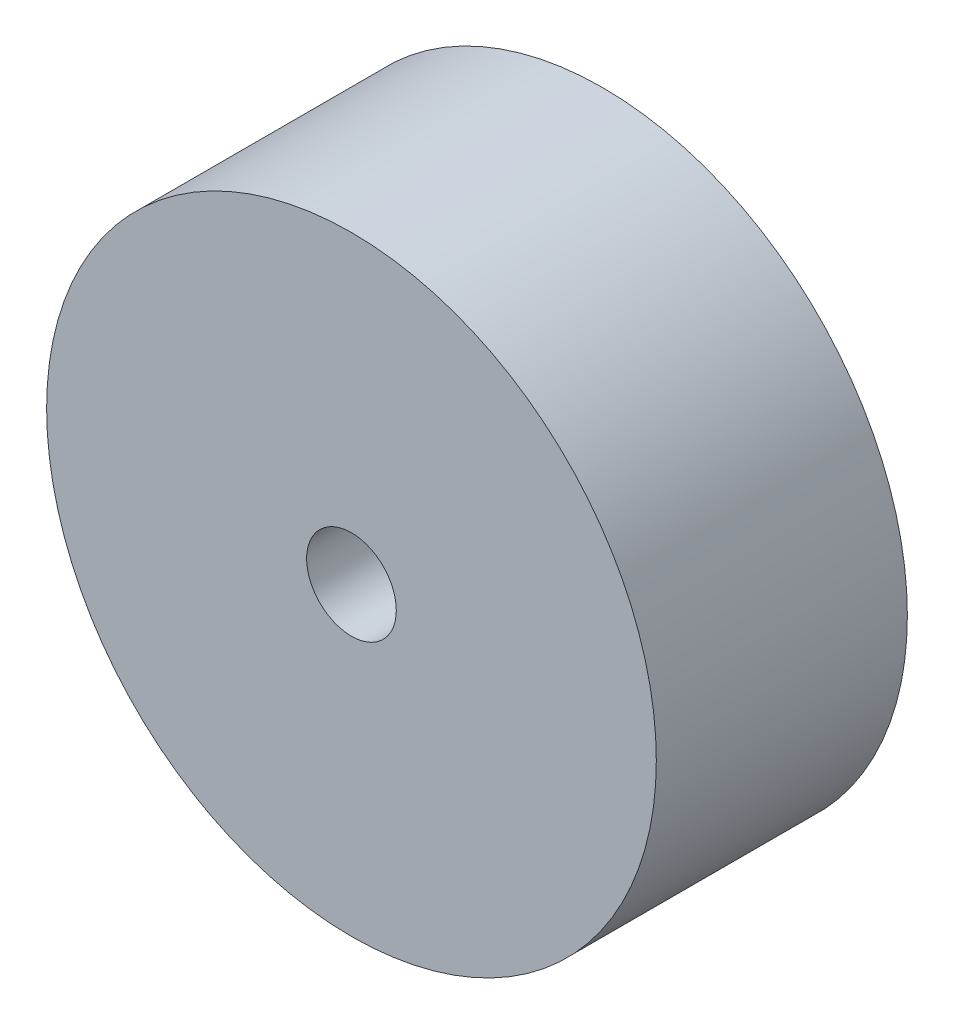
ISO-10303-21;
HEADER;
FILE_DESCRIPTION(('STEP AP214'),'2;1');
FILE_NAME('part.step','',(''),(''),'','','');
FILE_SCHEMA(('AUTOMOTIVE_DESIGN { 1 0 10303 214 1 1 1 1 }'));
ENDSEC;
DATA;
#1=APPLICATION_CONTEXT('core data for automotive mechanical design processes');
#2=APPLICATION_PROTOCOL_DEFINITION('international standard','automotive_design',2000,#1);
#3=PRODUCT_CONTEXT('',#1,'mechanical');
#4=PRODUCT('Part','Part','',(#3));
#5=PRODUCT_RELATED_PRODUCT_CATEGORY('part','',(#4));
#6=PRODUCT_DEFINITION_FORMATION('','',#4);
#7=PRODUCT_DEFINITION_CONTEXT('part definition',#1,'design');
#8=PRODUCT_DEFINITION('design','',#6,#7);
#9=PRODUCT_DEFINITION_SHAPE('','',#8);
#10=(LENGTH_UNIT() NAMED_UNIT(*) SI_UNIT(.MILLI.,.METRE.));
#11=(NAMED_UNIT(*) PLANE_ANGLE_UNIT() SI_UNIT($,.RADIAN.));
#12=(NAMED_UNIT(*) SI_UNIT($,.STERADIAN.) SOLID_ANGLE_UNIT());
#13=UNCERTAINTY_MEASURE_WITH_UNIT(LENGTH_MEASURE(1.E-05),#10,'distance_accuracy_value','');
#14=(GEOMETRIC_REPRESENTATION_CONTEXT(3) GLOBAL_UNCERTAINTY_ASSIGNED_CONTEXT((#13)) GLOBAL_UNIT_ASSIGNED_CONTEXT((#10,
#11,#12)) REPRESENTATION_CONTEXT('',''));
#15=CARTESIAN_POINT('',(0.,0.,0.));
#16=DIRECTION('',(0.,0.,1.));
#17=DIRECTION('',(1.,0.,0.));
#18=AXIS2_PLACEMENT_3D('',#15,#16,#17);
#19=CARTESIAN_POINT('',(-6.78347221813301,17.0584374897169,28.));
#20=DIRECTION('',(0.,0.,1.));
#21=DIRECTION('',(1.,0.,0.));
#22=AXIS2_PLACEMENT_3D('',#19,#20,#21);
#23=PLANE('',#22);
#24=CARTESIAN_POINT('',(-6.78347221813301,17.0584374897169,28.));
#25=DIRECTION('',(0.,0.,1.));
#26=DIRECTION('',(1.,0.,0.));
#27=AXIS2_PLACEMENT_3D('',#24,#25,#26);
#28=CIRCLE('',#27,34.);
#29=CARTESIAN_POINT('',(27.216527781867,17.0584374897169,28.));
#30=VERTEX_POINT('',#29);
#31=EDGE_CURVE('E10',#30,#30,#28,.T.);
#32=ORIENTED_EDGE('',*,*,#31,.T.);
#33=EDGE_LOOP('',(#32));
#34=FACE_BOUND('',#33,.T.);
#35=CARTESIAN_POINT('',(-6.78347221813301,17.0584374897169,28.));
#36=DIRECTION('',(0.,0.,1.));
#37=DIRECTION('',(1.,0.,0.));
#38=AXIS2_PLACEMENT_3D('',#35,#36,#37);
#39=CIRCLE('',#38,5.);
#40=CARTESIAN_POINT('',(-1.78347221813301,17.0584374897169,28.));
#41=VERTEX_POINT('',#40);
#42=EDGE_CURVE('E47',#41,#41,#39,.T.);
#43=ORIENTED_EDGE('',*,*,#42,.F.);
#44=EDGE_LOOP('',(#43));
#45=FACE_BOUND('',#44,.T.);
#46=ADVANCED_FACE('F36',(#34,#45),#23,.T.);
#47=CARTESIAN_POINT('',(-6.78347221813301,17.0584374897169,0.));
#48=DIRECTION('',(0.,0.,1.));
#49=DIRECTION('',(1.,0.,0.));
#50=AXIS2_PLACEMENT_3D('',#47,#48,#49);
#51=PLANE('',#50);
#52=CARTESIAN_POINT('',(-6.78347221813301,17.0584374897169,0.));
#53=DIRECTION('',(0.,0.,1.));
#54=DIRECTION('',(1.,0.,0.));
#55=AXIS2_PLACEMENT_3D('',#52,#53,#54);
#56=CIRCLE('',#55,34.);
#57=CARTESIAN_POINT('',(27.216527781867,17.0584374897169,0.));
#58=VERTEX_POINT('',#57);
#59=EDGE_CURVE('E40',#58,#58,#56,.T.);
#60=ORIENTED_EDGE('',*,*,#59,.F.);
#61=EDGE_LOOP('',(#60));
#62=FACE_BOUND('',#61,.T.);
#63=CARTESIAN_POINT('',(-6.78347221813301,17.0584374897169,0.));
#64=DIRECTION('',(0.,0.,1.));
#65=DIRECTION('',(1.,0.,0.));
#66=AXIS2_PLACEMENT_3D('',#63,#64,#65);
#67=CIRCLE('',#66,5.);
#68=CARTESIAN_POINT('',(-1.78347221813301,17.0584374897169,0.));
#69=VERTEX_POINT('',#68);
#70=EDGE_CURVE('E49',#69,#69,#67,.T.);
#71=ORIENTED_EDGE('',*,*,#70,.T.);
#72=EDGE_LOOP('',(#71));
#73=FACE_BOUND('',#72,.T.);
#74=ADVANCED_FACE('F59',(#62,#73),#51,.F.);
#75=CARTESIAN_POINT('',(-6.78347221813301,17.0584374897169,28.));
#76=DIRECTION('',(0.,0.,-1.));
#77=DIRECTION('',(-1.,0.,0.));
#78=AXIS2_PLACEMENT_3D('',#75,#76,#77);
#79=CYLINDRICAL_SURFACE('',#78,34.);
#80=ORIENTED_EDGE('',*,*,#31,.F.);
#81=EDGE_LOOP('',(#80));
#82=FACE_BOUND('',#81,.T.);
#83=ORIENTED_EDGE('',*,*,#59,.T.);
#84=EDGE_LOOP('',(#83));
#85=FACE_BOUND('',#84,.T.);
#86=ADVANCED_FACE('F38',(#82,#85),#79,.T.);
#87=CARTESIAN_POINT('',(-6.78347221813301,17.0584374897169,28.));
#88=DIRECTION('',(0.,0.,-1.));
#89=DIRECTION('',(-1.,0.,0.));
#90=AXIS2_PLACEMENT_3D('',#87,#88,#89);
#91=CYLINDRICAL_SURFACE('',#90,5.);
#92=ORIENTED_EDGE('',*,*,#42,.T.);
#93=EDGE_LOOP('',(#92));
#94=FACE_BOUND('',#93,.T.);
#95=ORIENTED_EDGE('',*,*,#70,.F.);
#96=EDGE_LOOP('',(#95));
#97=FACE_BOUND('',#96,.T.);
#98=ADVANCED_FACE('F55',(#94,#97),#91,.F.);
#99=CLOSED_SHELL('',(#46,#74,#86,#98));
#100=MANIFOLD_SOLID_BREP('B2',#99);
#101=ADVANCED_BREP_SHAPE_REPRESENTATION('',(#18,#100),#14);
#102=SHAPE_DEFINITION_REPRESENTATION(#9,#101);
ENDSEC;
END-ISO-10303-21;
